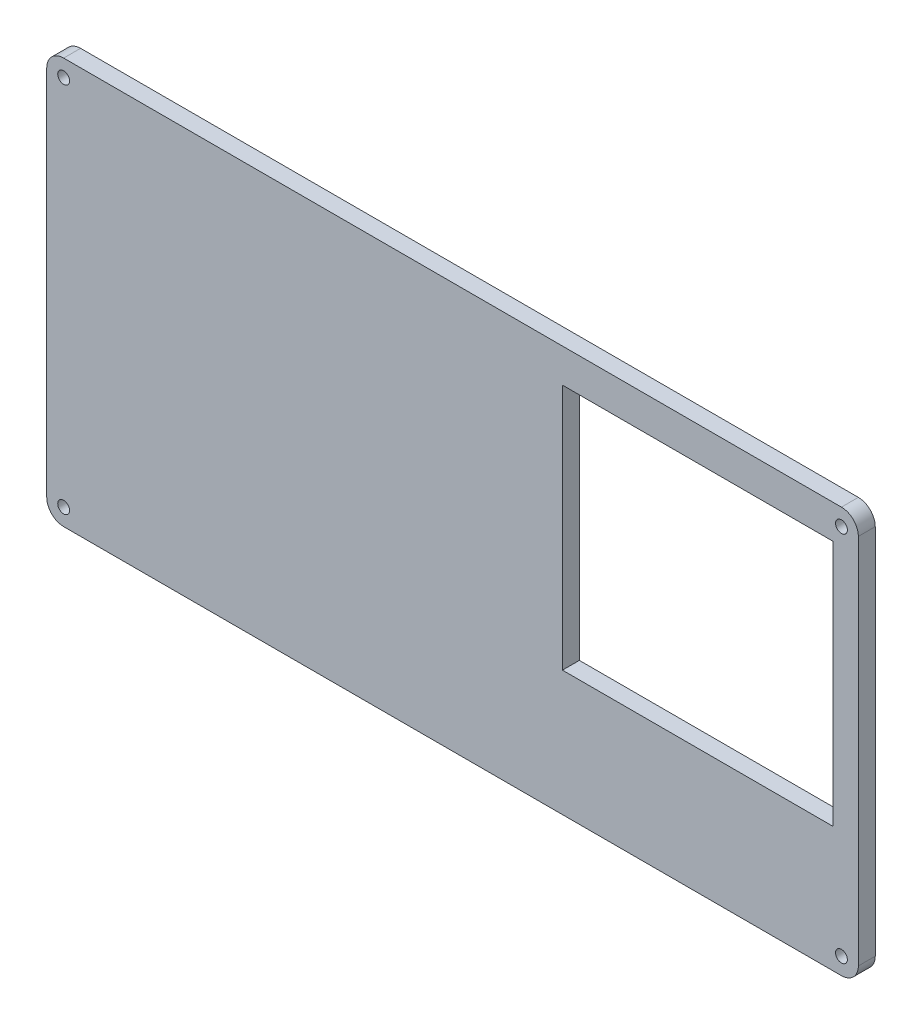
ISO-10303-21;
HEADER;
FILE_DESCRIPTION(('STEP AP214'),'2;1');
FILE_NAME('part.step','',(''),(''),'','','');
FILE_SCHEMA(('AUTOMOTIVE_DESIGN { 1 0 10303 214 1 1 1 1 }'));
ENDSEC;
DATA;
#1=APPLICATION_CONTEXT('core data for automotive mechanical design processes');
#2=APPLICATION_PROTOCOL_DEFINITION('international standard','automotive_design',2000,#1);
#3=PRODUCT_CONTEXT('',#1,'mechanical');
#4=PRODUCT('Part','Part','',(#3));
#5=PRODUCT_RELATED_PRODUCT_CATEGORY('part','',(#4));
#6=PRODUCT_DEFINITION_FORMATION('','',#4);
#7=PRODUCT_DEFINITION_CONTEXT('part definition',#1,'design');
#8=PRODUCT_DEFINITION('design','',#6,#7);
#9=PRODUCT_DEFINITION_SHAPE('','',#8);
#10=(LENGTH_UNIT() NAMED_UNIT(*) SI_UNIT(.MILLI.,.METRE.));
#11=(NAMED_UNIT(*) PLANE_ANGLE_UNIT() SI_UNIT($,.RADIAN.));
#12=(NAMED_UNIT(*) SI_UNIT($,.STERADIAN.) SOLID_ANGLE_UNIT());
#13=UNCERTAINTY_MEASURE_WITH_UNIT(LENGTH_MEASURE(1.E-05),#10,'distance_accuracy_value','');
#14=(GEOMETRIC_REPRESENTATION_CONTEXT(3) GLOBAL_UNCERTAINTY_ASSIGNED_CONTEXT((#13)) GLOBAL_UNIT_ASSIGNED_CONTEXT((#10,
#11,#12)) REPRESENTATION_CONTEXT('',''));
#15=CARTESIAN_POINT('',(0.,0.,0.));
#16=DIRECTION('',(0.,0.,1.));
#17=DIRECTION('',(1.,0.,0.));
#18=AXIS2_PLACEMENT_3D('',#15,#16,#17);
#19=CARTESIAN_POINT('',(-115.,54.9999999999999,5.));
#20=DIRECTION('',(0.,0.,-1.));
#21=DIRECTION('',(-1.,0.,0.));
#22=AXIS2_PLACEMENT_3D('',#19,#20,#21);
#23=CYLINDRICAL_SURFACE('',#22,4.99999999999996);
#24=CARTESIAN_POINT('',(-115.,54.9999999999999,0.));
#25=DIRECTION('',(0.,0.,1.));
#26=DIRECTION('',(1.,0.,0.));
#27=AXIS2_PLACEMENT_3D('',#24,#25,#26);
#28=CIRCLE('',#27,4.99999999999996);
#29=CARTESIAN_POINT('',(-115.,59.9999999999999,0.));
#30=VERTEX_POINT('',#29);
#31=CARTESIAN_POINT('',(-120.,55.,0.));
#32=VERTEX_POINT('',#31);
#33=EDGE_CURVE('E190',#30,#32,#28,.T.);
#34=ORIENTED_EDGE('',*,*,#33,.T.);
#35=DIRECTION('',(0.,0.,-1.));
#36=VECTOR('',#35,1.);
#37=CARTESIAN_POINT('',(-120.,55.,5.));
#38=LINE('',#37,#36);
#39=CARTESIAN_POINT('',(-120.,55.,5.));
#40=VERTEX_POINT('',#39);
#41=EDGE_CURVE('E11',#40,#32,#38,.T.);
#42=ORIENTED_EDGE('',*,*,#41,.F.);
#43=CARTESIAN_POINT('',(-115.,54.9999999999999,5.));
#44=DIRECTION('',(0.,0.,1.));
#45=DIRECTION('',(1.,0.,0.));
#46=AXIS2_PLACEMENT_3D('',#43,#44,#45);
#47=CIRCLE('',#46,4.99999999999996);
#48=CARTESIAN_POINT('',(-115.,59.9999999999999,5.));
#49=VERTEX_POINT('',#48);
#50=EDGE_CURVE('E189',#49,#40,#47,.T.);
#51=ORIENTED_EDGE('',*,*,#50,.F.);
#52=DIRECTION('',(0.,0.,-1.));
#53=VECTOR('',#52,1.);
#54=CARTESIAN_POINT('',(-115.,59.9999999999999,5.));
#55=LINE('',#54,#53);
#56=EDGE_CURVE('E208',#49,#30,#55,.T.);
#57=ORIENTED_EDGE('',*,*,#56,.T.);
#58=EDGE_LOOP('',(#34,#42,#51,#57));
#59=FACE_BOUND('',#58,.T.);
#60=ADVANCED_FACE('F41',(#59),#23,.T.);
#61=CARTESIAN_POINT('',(-120.,55.,5.));
#62=DIRECTION('',(1.,0.,0.));
#63=DIRECTION('',(0.,0.,-1.));
#64=AXIS2_PLACEMENT_3D('',#61,#62,#63);
#65=PLANE('',#64);
#66=DIRECTION('',(0.,-1.,0.));
#67=VECTOR('',#66,1.);
#68=CARTESIAN_POINT('',(-120.,55.,0.));
#69=LINE('',#68,#67);
#70=CARTESIAN_POINT('',(-120.,-55.,0.));
#71=VERTEX_POINT('',#70);
#72=EDGE_CURVE('E211',#32,#71,#69,.T.);
#73=ORIENTED_EDGE('',*,*,#72,.T.);
#74=DIRECTION('',(0.,0.,-1.));
#75=VECTOR('',#74,1.);
#76=CARTESIAN_POINT('',(-120.,-55.,5.));
#77=LINE('',#76,#75);
#78=CARTESIAN_POINT('',(-120.,-55.,5.));
#79=VERTEX_POINT('',#78);
#80=EDGE_CURVE('E48',#79,#71,#77,.T.);
#81=ORIENTED_EDGE('',*,*,#80,.F.);
#82=DIRECTION('',(0.,-1.,0.));
#83=VECTOR('',#82,1.);
#84=CARTESIAN_POINT('',(-120.,55.,5.));
#85=LINE('',#84,#83);
#86=EDGE_CURVE('E194',#40,#79,#85,.T.);
#87=ORIENTED_EDGE('',*,*,#86,.F.);
#88=ORIENTED_EDGE('',*,*,#41,.T.);
#89=EDGE_LOOP('',(#73,#81,#87,#88));
#90=FACE_BOUND('',#89,.T.);
#91=ADVANCED_FACE('F270',(#90),#65,.F.);
#92=CARTESIAN_POINT('',(-115.,-55.,5.));
#93=DIRECTION('',(0.,0.,-1.));
#94=DIRECTION('',(-1.,0.,0.));
#95=AXIS2_PLACEMENT_3D('',#92,#93,#94);
#96=CYLINDRICAL_SURFACE('',#95,4.99999999999995);
#97=CARTESIAN_POINT('',(-115.,-55.,0.));
#98=DIRECTION('',(0.,0.,1.));
#99=DIRECTION('',(1.,0.,0.));
#100=AXIS2_PLACEMENT_3D('',#97,#98,#99);
#101=CIRCLE('',#100,4.99999999999995);
#102=CARTESIAN_POINT('',(-115.,-59.9999999999999,0.));
#103=VERTEX_POINT('',#102);
#104=EDGE_CURVE('E213',#71,#103,#101,.T.);
#105=ORIENTED_EDGE('',*,*,#104,.T.);
#106=DIRECTION('',(0.,0.,-1.));
#107=VECTOR('',#106,1.);
#108=CARTESIAN_POINT('',(-115.,-59.9999999999999,5.));
#109=LINE('',#108,#107);
#110=CARTESIAN_POINT('',(-115.,-59.9999999999999,5.));
#111=VERTEX_POINT('',#110);
#112=EDGE_CURVE('E236',#111,#103,#109,.T.);
#113=ORIENTED_EDGE('',*,*,#112,.F.);
#114=CARTESIAN_POINT('',(-115.,-55.,5.));
#115=DIRECTION('',(0.,0.,1.));
#116=DIRECTION('',(1.,0.,0.));
#117=AXIS2_PLACEMENT_3D('',#114,#115,#116);
#118=CIRCLE('',#117,4.99999999999995);
#119=EDGE_CURVE('E198',#79,#111,#118,.T.);
#120=ORIENTED_EDGE('',*,*,#119,.F.);
#121=ORIENTED_EDGE('',*,*,#80,.T.);
#122=EDGE_LOOP('',(#105,#113,#120,#121));
#123=FACE_BOUND('',#122,.T.);
#124=ADVANCED_FACE('F244',(#123),#96,.T.);
#125=CARTESIAN_POINT('',(-115.,-59.9999999999999,5.));
#126=DIRECTION('',(0.,1.,0.));
#127=DIRECTION('',(-1.,0.,0.));
#128=AXIS2_PLACEMENT_3D('',#125,#126,#127);
#129=PLANE('',#128);
#130=DIRECTION('',(1.,0.,0.));
#131=VECTOR('',#130,1.);
#132=CARTESIAN_POINT('',(-115.,-59.9999999999999,0.));
#133=LINE('',#132,#131);
#134=CARTESIAN_POINT('',(115.,-59.9999999999999,0.));
#135=VERTEX_POINT('',#134);
#136=EDGE_CURVE('E214',#103,#135,#133,.T.);
#137=ORIENTED_EDGE('',*,*,#136,.T.);
#138=DIRECTION('',(0.,0.,-1.));
#139=VECTOR('',#138,1.);
#140=CARTESIAN_POINT('',(115.,-59.9999999999999,5.));
#141=LINE('',#140,#139);
#142=CARTESIAN_POINT('',(115.,-59.9999999999999,5.));
#143=VERTEX_POINT('',#142);
#144=EDGE_CURVE('E233',#143,#135,#141,.T.);
#145=ORIENTED_EDGE('',*,*,#144,.F.);
#146=DIRECTION('',(1.,0.,0.));
#147=VECTOR('',#146,1.);
#148=CARTESIAN_POINT('',(-115.,-59.9999999999999,5.));
#149=LINE('',#148,#147);
#150=EDGE_CURVE('E196',#111,#143,#149,.T.);
#151=ORIENTED_EDGE('',*,*,#150,.F.);
#152=ORIENTED_EDGE('',*,*,#112,.T.);
#153=EDGE_LOOP('',(#137,#145,#151,#152));
#154=FACE_BOUND('',#153,.T.);
#155=ADVANCED_FACE('F254',(#154),#129,.F.);
#156=CARTESIAN_POINT('',(115.,-55.,5.));
#157=DIRECTION('',(0.,0.,-1.));
#158=DIRECTION('',(-1.,0.,0.));
#159=AXIS2_PLACEMENT_3D('',#156,#157,#158);
#160=CYLINDRICAL_SURFACE('',#159,4.99999999999994);
#161=CARTESIAN_POINT('',(115.,-55.,0.));
#162=DIRECTION('',(0.,0.,1.));
#163=DIRECTION('',(-1.,0.,0.));
#164=AXIS2_PLACEMENT_3D('',#161,#162,#163);
#165=CIRCLE('',#164,4.99999999999994);
#166=CARTESIAN_POINT('',(120.,-54.9999999999999,0.));
#167=VERTEX_POINT('',#166);
#168=EDGE_CURVE('E220',#135,#167,#165,.T.);
#169=ORIENTED_EDGE('',*,*,#168,.T.);
#170=DIRECTION('',(0.,0.,-1.));
#171=VECTOR('',#170,1.);
#172=CARTESIAN_POINT('',(120.,-54.9999999999999,5.));
#173=LINE('',#172,#171);
#174=CARTESIAN_POINT('',(120.,-54.9999999999999,5.));
#175=VERTEX_POINT('',#174);
#176=EDGE_CURVE('E235',#175,#167,#173,.T.);
#177=ORIENTED_EDGE('',*,*,#176,.F.);
#178=CARTESIAN_POINT('',(115.,-55.,5.));
#179=DIRECTION('',(0.,0.,1.));
#180=DIRECTION('',(-1.,0.,0.));
#181=AXIS2_PLACEMENT_3D('',#178,#179,#180);
#182=CIRCLE('',#181,4.99999999999994);
#183=EDGE_CURVE('E199',#143,#175,#182,.T.);
#184=ORIENTED_EDGE('',*,*,#183,.F.);
#185=ORIENTED_EDGE('',*,*,#144,.T.);
#186=EDGE_LOOP('',(#169,#177,#184,#185));
#187=FACE_BOUND('',#186,.T.);
#188=ADVANCED_FACE('F259',(#187),#160,.T.);
#189=CARTESIAN_POINT('',(120.,55.,5.));
#190=DIRECTION('',(-1.,0.,0.));
#191=DIRECTION('',(0.,-1.,0.));
#192=AXIS2_PLACEMENT_3D('',#189,#190,#191);
#193=PLANE('',#192);
#194=DIRECTION('',(0.,1.,0.));
#195=VECTOR('',#194,1.);
#196=CARTESIAN_POINT('',(120.,55.,0.));
#197=LINE('',#196,#195);
#198=CARTESIAN_POINT('',(120.,55.,0.));
#199=VERTEX_POINT('',#198);
#200=EDGE_CURVE('E218',#167,#199,#197,.T.);
#201=ORIENTED_EDGE('',*,*,#200,.T.);
#202=DIRECTION('',(0.,0.,-1.));
#203=VECTOR('',#202,1.);
#204=CARTESIAN_POINT('',(120.,55.,5.));
#205=LINE('',#204,#203);
#206=CARTESIAN_POINT('',(120.,55.,5.));
#207=VERTEX_POINT('',#206);
#208=EDGE_CURVE('E228',#207,#199,#205,.T.);
#209=ORIENTED_EDGE('',*,*,#208,.F.);
#210=DIRECTION('',(0.,1.,0.));
#211=VECTOR('',#210,1.);
#212=CARTESIAN_POINT('',(120.,55.,5.));
#213=LINE('',#212,#211);
#214=EDGE_CURVE('E205',#175,#207,#213,.T.);
#215=ORIENTED_EDGE('',*,*,#214,.F.);
#216=ORIENTED_EDGE('',*,*,#176,.T.);
#217=EDGE_LOOP('',(#201,#209,#215,#216));
#218=FACE_BOUND('',#217,.T.);
#219=ADVANCED_FACE('F278',(#218),#193,.F.);
#220=CARTESIAN_POINT('',(115.,55.,5.));
#221=DIRECTION('',(0.,0.,-1.));
#222=DIRECTION('',(-1.,0.,0.));
#223=AXIS2_PLACEMENT_3D('',#220,#221,#222);
#224=CYLINDRICAL_SURFACE('',#223,4.99999999999996);
#225=CARTESIAN_POINT('',(115.,55.,0.));
#226=DIRECTION('',(0.,0.,1.));
#227=DIRECTION('',(-1.,0.,0.));
#228=AXIS2_PLACEMENT_3D('',#225,#226,#227);
#229=CIRCLE('',#228,4.99999999999996);
#230=CARTESIAN_POINT('',(115.,60.,0.));
#231=VERTEX_POINT('',#230);
#232=EDGE_CURVE('E222',#199,#231,#229,.T.);
#233=ORIENTED_EDGE('',*,*,#232,.T.);
#234=DIRECTION('',(0.,0.,-1.));
#235=VECTOR('',#234,1.);
#236=CARTESIAN_POINT('',(115.,60.,5.));
#237=LINE('',#236,#235);
#238=CARTESIAN_POINT('',(115.,60.,5.));
#239=VERTEX_POINT('',#238);
#240=EDGE_CURVE('E226',#239,#231,#237,.T.);
#241=ORIENTED_EDGE('',*,*,#240,.F.);
#242=CARTESIAN_POINT('',(115.,55.,5.));
#243=DIRECTION('',(0.,0.,1.));
#244=DIRECTION('',(-1.,0.,0.));
#245=AXIS2_PLACEMENT_3D('',#242,#243,#244);
#246=CIRCLE('',#245,4.99999999999996);
#247=EDGE_CURVE('E204',#207,#239,#246,.T.);
#248=ORIENTED_EDGE('',*,*,#247,.F.);
#249=ORIENTED_EDGE('',*,*,#208,.T.);
#250=EDGE_LOOP('',(#233,#241,#248,#249));
#251=FACE_BOUND('',#250,.T.);
#252=ADVANCED_FACE('F279',(#251),#224,.T.);
#253=CARTESIAN_POINT('',(-115.,59.9999999999999,5.));
#254=DIRECTION('',(0.,-1.,0.));
#255=DIRECTION('',(1.,0.,0.));
#256=AXIS2_PLACEMENT_3D('',#253,#254,#255);
#257=PLANE('',#256);
#258=DIRECTION('',(-1.,0.,0.));
#259=VECTOR('',#258,1.);
#260=CARTESIAN_POINT('',(-115.,59.9999999999999,0.));
#261=LINE('',#260,#259);
#262=EDGE_CURVE('E191',#231,#30,#261,.T.);
#263=ORIENTED_EDGE('',*,*,#262,.T.);
#264=ORIENTED_EDGE('',*,*,#56,.F.);
#265=DIRECTION('',(-1.,0.,0.));
#266=VECTOR('',#265,1.);
#267=CARTESIAN_POINT('',(-115.,59.9999999999999,5.));
#268=LINE('',#267,#266);
#269=EDGE_CURVE('E206',#239,#49,#268,.T.);
#270=ORIENTED_EDGE('',*,*,#269,.F.);
#271=ORIENTED_EDGE('',*,*,#240,.T.);
#272=EDGE_LOOP('',(#263,#264,#270,#271));
#273=FACE_BOUND('',#272,.T.);
#274=ADVANCED_FACE('F272',(#273),#257,.F.);
#275=CARTESIAN_POINT('',(-115.,54.9999999999999,5.));
#276=DIRECTION('',(0.,0.,1.));
#277=DIRECTION('',(1.,0.,0.));
#278=AXIS2_PLACEMENT_3D('',#275,#276,#277);
#279=PLANE('',#278);
#280=DIRECTION('',(0.,-1.,0.));
#281=VECTOR('',#280,1.);
#282=CARTESIAN_POINT('',(32.5,50.,5.));
#283=LINE('',#282,#281);
#284=CARTESIAN_POINT('',(32.5,50.,5.));
#285=VERTEX_POINT('',#284);
#286=CARTESIAN_POINT('',(32.5000000000001,-23.,5.));
#287=VERTEX_POINT('',#286);
#288=EDGE_CURVE('E54',#285,#287,#283,.T.);
#289=ORIENTED_EDGE('',*,*,#288,.F.);
#290=DIRECTION('',(-1.,0.,0.));
#291=VECTOR('',#290,1.);
#292=CARTESIAN_POINT('',(32.5,50.,5.));
#293=LINE('',#292,#291);
#294=CARTESIAN_POINT('',(112.5,50.,5.));
#295=VERTEX_POINT('',#294);
#296=EDGE_CURVE('E150',#295,#285,#293,.T.);
#297=ORIENTED_EDGE('',*,*,#296,.F.);
#298=DIRECTION('',(0.,1.,0.));
#299=VECTOR('',#298,1.);
#300=CARTESIAN_POINT('',(112.5,50.,5.));
#301=LINE('',#300,#299);
#302=CARTESIAN_POINT('',(112.5,-23.,5.));
#303=VERTEX_POINT('',#302);
#304=EDGE_CURVE('E147',#303,#295,#301,.T.);
#305=ORIENTED_EDGE('',*,*,#304,.F.);
#306=DIRECTION('',(1.,0.,0.));
#307=VECTOR('',#306,1.);
#308=CARTESIAN_POINT('',(32.5,-23.,5.));
#309=LINE('',#308,#307);
#310=EDGE_CURVE('E156',#287,#303,#309,.T.);
#311=ORIENTED_EDGE('',*,*,#310,.F.);
#312=EDGE_LOOP('',(#289,#297,#305,#311));
#313=FACE_BOUND('',#312,.T.);
#314=CARTESIAN_POINT('',(-115.,-54.9999999999999,5.));
#315=DIRECTION('',(0.,0.,1.));
#316=DIRECTION('',(-1.,0.,0.));
#317=AXIS2_PLACEMENT_3D('',#314,#315,#316);
#318=CIRCLE('',#317,1.75);
#319=CARTESIAN_POINT('',(-116.75,-54.9999999999999,5.));
#320=VERTEX_POINT('',#319);
#321=EDGE_CURVE('E176',#320,#320,#318,.T.);
#322=ORIENTED_EDGE('',*,*,#321,.F.);
#323=EDGE_LOOP('',(#322));
#324=FACE_BOUND('',#323,.T.);
#325=CARTESIAN_POINT('',(115.,-55.,5.));
#326=DIRECTION('',(0.,0.,1.));
#327=DIRECTION('',(1.,0.,0.));
#328=AXIS2_PLACEMENT_3D('',#325,#326,#327);
#329=CIRCLE('',#328,1.75);
#330=CARTESIAN_POINT('',(116.75,-55.,5.));
#331=VERTEX_POINT('',#330);
#332=EDGE_CURVE('E172',#331,#331,#329,.T.);
#333=ORIENTED_EDGE('',*,*,#332,.F.);
#334=EDGE_LOOP('',(#333));
#335=FACE_BOUND('',#334,.T.);
#336=CARTESIAN_POINT('',(115.,55.,5.));
#337=DIRECTION('',(0.,0.,1.));
#338=DIRECTION('',(-1.,0.,0.));
#339=AXIS2_PLACEMENT_3D('',#336,#337,#338);
#340=CIRCLE('',#339,1.75);
#341=CARTESIAN_POINT('',(113.25,55.,5.));
#342=VERTEX_POINT('',#341);
#343=EDGE_CURVE('E167',#342,#342,#340,.T.);
#344=ORIENTED_EDGE('',*,*,#343,.F.);
#345=EDGE_LOOP('',(#344));
#346=FACE_BOUND('',#345,.T.);
#347=CARTESIAN_POINT('',(-115.,54.9999999999999,5.));
#348=DIRECTION('',(0.,0.,1.));
#349=DIRECTION('',(1.,0.,0.));
#350=AXIS2_PLACEMENT_3D('',#347,#348,#349);
#351=CIRCLE('',#350,1.75);
#352=CARTESIAN_POINT('',(-113.25,54.9999999999999,5.));
#353=VERTEX_POINT('',#352);
#354=EDGE_CURVE('E166',#353,#353,#351,.T.);
#355=ORIENTED_EDGE('',*,*,#354,.F.);
#356=EDGE_LOOP('',(#355));
#357=FACE_BOUND('',#356,.T.);
#358=ORIENTED_EDGE('',*,*,#50,.T.);
#359=ORIENTED_EDGE('',*,*,#86,.T.);
#360=ORIENTED_EDGE('',*,*,#119,.T.);
#361=ORIENTED_EDGE('',*,*,#150,.T.);
#362=ORIENTED_EDGE('',*,*,#183,.T.);
#363=ORIENTED_EDGE('',*,*,#214,.T.);
#364=ORIENTED_EDGE('',*,*,#247,.T.);
#365=ORIENTED_EDGE('',*,*,#269,.T.);
#366=EDGE_LOOP('',(#358,#359,#360,#361,#362,#363,#364,#365));
#367=FACE_BOUND('',#366,.T.);
#368=ADVANCED_FACE('F263',(#313,#324,#335,#346,#357,#367),#279,.T.);
#369=CARTESIAN_POINT('',(-115.,54.9999999999999,0.));
#370=DIRECTION('',(0.,0.,1.));
#371=DIRECTION('',(1.,0.,0.));
#372=AXIS2_PLACEMENT_3D('',#369,#370,#371);
#373=PLANE('',#372);
#374=DIRECTION('',(-1.,0.,0.));
#375=VECTOR('',#374,1.);
#376=CARTESIAN_POINT('',(32.5,50.,0.));
#377=LINE('',#376,#375);
#378=CARTESIAN_POINT('',(112.5,50.,0.));
#379=VERTEX_POINT('',#378);
#380=CARTESIAN_POINT('',(32.5,50.,0.));
#381=VERTEX_POINT('',#380);
#382=EDGE_CURVE('E140',#379,#381,#377,.T.);
#383=ORIENTED_EDGE('',*,*,#382,.T.);
#384=DIRECTION('',(0.,-1.,0.));
#385=VECTOR('',#384,1.);
#386=CARTESIAN_POINT('',(32.5,50.,0.));
#387=LINE('',#386,#385);
#388=CARTESIAN_POINT('',(32.5,-23.,0.));
#389=VERTEX_POINT('',#388);
#390=EDGE_CURVE('E131',#381,#389,#387,.T.);
#391=ORIENTED_EDGE('',*,*,#390,.T.);
#392=DIRECTION('',(1.,0.,0.));
#393=VECTOR('',#392,1.);
#394=CARTESIAN_POINT('',(32.5,-23.,0.));
#395=LINE('',#394,#393);
#396=CARTESIAN_POINT('',(112.5,-23.,0.));
#397=VERTEX_POINT('',#396);
#398=EDGE_CURVE('E138',#389,#397,#395,.T.);
#399=ORIENTED_EDGE('',*,*,#398,.T.);
#400=DIRECTION('',(0.,1.,0.));
#401=VECTOR('',#400,1.);
#402=CARTESIAN_POINT('',(112.5,50.,0.));
#403=LINE('',#402,#401);
#404=EDGE_CURVE('E62',#397,#379,#403,.T.);
#405=ORIENTED_EDGE('',*,*,#404,.T.);
#406=EDGE_LOOP('',(#383,#391,#399,#405));
#407=FACE_BOUND('',#406,.T.);
#408=CARTESIAN_POINT('',(-115.,-54.9999999999999,0.));
#409=DIRECTION('',(0.,0.,1.));
#410=DIRECTION('',(-1.,0.,0.));
#411=AXIS2_PLACEMENT_3D('',#408,#409,#410);
#412=CIRCLE('',#411,1.75);
#413=CARTESIAN_POINT('',(-116.75,-54.9999999999999,0.));
#414=VERTEX_POINT('',#413);
#415=EDGE_CURVE('E165',#414,#414,#412,.T.);
#416=ORIENTED_EDGE('',*,*,#415,.T.);
#417=EDGE_LOOP('',(#416));
#418=FACE_BOUND('',#417,.T.);
#419=CARTESIAN_POINT('',(115.,-55.,0.));
#420=DIRECTION('',(0.,0.,1.));
#421=DIRECTION('',(1.,0.,0.));
#422=AXIS2_PLACEMENT_3D('',#419,#420,#421);
#423=CIRCLE('',#422,1.75);
#424=CARTESIAN_POINT('',(116.75,-55.,0.));
#425=VERTEX_POINT('',#424);
#426=EDGE_CURVE('E177',#425,#425,#423,.T.);
#427=ORIENTED_EDGE('',*,*,#426,.T.);
#428=EDGE_LOOP('',(#427));
#429=FACE_BOUND('',#428,.T.);
#430=CARTESIAN_POINT('',(115.,55.,0.));
#431=DIRECTION('',(0.,0.,1.));
#432=DIRECTION('',(-1.,0.,0.));
#433=AXIS2_PLACEMENT_3D('',#430,#431,#432);
#434=CIRCLE('',#433,1.75);
#435=CARTESIAN_POINT('',(113.25,55.,0.));
#436=VERTEX_POINT('',#435);
#437=EDGE_CURVE('E168',#436,#436,#434,.T.);
#438=ORIENTED_EDGE('',*,*,#437,.T.);
#439=EDGE_LOOP('',(#438));
#440=FACE_BOUND('',#439,.T.);
#441=CARTESIAN_POINT('',(-115.,54.9999999999999,0.));
#442=DIRECTION('',(0.,0.,1.));
#443=DIRECTION('',(1.,0.,0.));
#444=AXIS2_PLACEMENT_3D('',#441,#442,#443);
#445=CIRCLE('',#444,1.75);
#446=CARTESIAN_POINT('',(-113.25,54.9999999999999,0.));
#447=VERTEX_POINT('',#446);
#448=EDGE_CURVE('E184',#447,#447,#445,.T.);
#449=ORIENTED_EDGE('',*,*,#448,.T.);
#450=EDGE_LOOP('',(#449));
#451=FACE_BOUND('',#450,.T.);
#452=ORIENTED_EDGE('',*,*,#33,.F.);
#453=ORIENTED_EDGE('',*,*,#262,.F.);
#454=ORIENTED_EDGE('',*,*,#232,.F.);
#455=ORIENTED_EDGE('',*,*,#200,.F.);
#456=ORIENTED_EDGE('',*,*,#168,.F.);
#457=ORIENTED_EDGE('',*,*,#136,.F.);
#458=ORIENTED_EDGE('',*,*,#104,.F.);
#459=ORIENTED_EDGE('',*,*,#72,.F.);
#460=EDGE_LOOP('',(#452,#453,#454,#455,#456,#457,#458,#459));
#461=FACE_BOUND('',#460,.T.);
#462=ADVANCED_FACE('F145',(#407,#418,#429,#440,#451,#461),#373,.F.);
#463=CARTESIAN_POINT('',(-115.,54.9999999999999,0.));
#464=DIRECTION('',(0.,0.,1.));
#465=DIRECTION('',(1.,0.,0.));
#466=AXIS2_PLACEMENT_3D('',#463,#464,#465);
#467=CYLINDRICAL_SURFACE('',#466,1.75);
#468=ORIENTED_EDGE('',*,*,#448,.F.);
#469=EDGE_LOOP('',(#468));
#470=FACE_BOUND('',#469,.T.);
#471=ORIENTED_EDGE('',*,*,#354,.T.);
#472=EDGE_LOOP('',(#471));
#473=FACE_BOUND('',#472,.T.);
#474=ADVANCED_FACE('F350',(#470,#473),#467,.F.);
#475=CARTESIAN_POINT('',(115.,55.,0.));
#476=DIRECTION('',(0.,0.,1.));
#477=DIRECTION('',(1.,0.,0.));
#478=AXIS2_PLACEMENT_3D('',#475,#476,#477);
#479=CYLINDRICAL_SURFACE('',#478,1.75);
#480=ORIENTED_EDGE('',*,*,#437,.F.);
#481=EDGE_LOOP('',(#480));
#482=FACE_BOUND('',#481,.T.);
#483=ORIENTED_EDGE('',*,*,#343,.T.);
#484=EDGE_LOOP('',(#483));
#485=FACE_BOUND('',#484,.T.);
#486=ADVANCED_FACE('F357',(#482,#485),#479,.F.);
#487=CARTESIAN_POINT('',(115.,-55.,0.));
#488=DIRECTION('',(0.,0.,1.));
#489=DIRECTION('',(1.,0.,0.));
#490=AXIS2_PLACEMENT_3D('',#487,#488,#489);
#491=CYLINDRICAL_SURFACE('',#490,1.75);
#492=ORIENTED_EDGE('',*,*,#426,.F.);
#493=EDGE_LOOP('',(#492));
#494=FACE_BOUND('',#493,.T.);
#495=ORIENTED_EDGE('',*,*,#332,.T.);
#496=EDGE_LOOP('',(#495));
#497=FACE_BOUND('',#496,.T.);
#498=ADVANCED_FACE('F368',(#494,#497),#491,.F.);
#499=CARTESIAN_POINT('',(-115.,-54.9999999999999,0.));
#500=DIRECTION('',(0.,0.,1.));
#501=DIRECTION('',(1.,0.,0.));
#502=AXIS2_PLACEMENT_3D('',#499,#500,#501);
#503=CYLINDRICAL_SURFACE('',#502,1.75);
#504=ORIENTED_EDGE('',*,*,#415,.F.);
#505=EDGE_LOOP('',(#504));
#506=FACE_BOUND('',#505,.T.);
#507=ORIENTED_EDGE('',*,*,#321,.T.);
#508=EDGE_LOOP('',(#507));
#509=FACE_BOUND('',#508,.T.);
#510=ADVANCED_FACE('F376',(#506,#509),#503,.F.);
#511=CARTESIAN_POINT('',(32.5,50.,0.));
#512=DIRECTION('',(-1.,0.,0.));
#513=DIRECTION('',(0.,-1.,0.));
#514=AXIS2_PLACEMENT_3D('',#511,#512,#513);
#515=PLANE('',#514);
#516=ORIENTED_EDGE('',*,*,#288,.T.);
#517=DIRECTION('',(0.,0.,1.));
#518=VECTOR('',#517,1.);
#519=CARTESIAN_POINT('',(32.5,-23.,0.));
#520=LINE('',#519,#518);
#521=EDGE_CURVE('E130',#389,#287,#520,.T.);
#522=ORIENTED_EDGE('',*,*,#521,.F.);
#523=ORIENTED_EDGE('',*,*,#390,.F.);
#524=DIRECTION('',(0.,0.,1.));
#525=VECTOR('',#524,1.);
#526=CARTESIAN_POINT('',(32.5,50.,0.));
#527=LINE('',#526,#525);
#528=EDGE_CURVE('E159',#381,#285,#527,.T.);
#529=ORIENTED_EDGE('',*,*,#528,.T.);
#530=EDGE_LOOP('',(#516,#522,#523,#529));
#531=FACE_BOUND('',#530,.T.);
#532=ADVANCED_FACE('F129',(#531),#515,.F.);
#533=CARTESIAN_POINT('',(32.5,50.,0.));
#534=DIRECTION('',(0.,1.,0.));
#535=DIRECTION('',(-1.,0.,0.));
#536=AXIS2_PLACEMENT_3D('',#533,#534,#535);
#537=PLANE('',#536);
#538=ORIENTED_EDGE('',*,*,#296,.T.);
#539=ORIENTED_EDGE('',*,*,#528,.F.);
#540=ORIENTED_EDGE('',*,*,#382,.F.);
#541=DIRECTION('',(0.,0.,1.));
#542=VECTOR('',#541,1.);
#543=CARTESIAN_POINT('',(112.5,50.,0.));
#544=LINE('',#543,#542);
#545=EDGE_CURVE('E162',#379,#295,#544,.T.);
#546=ORIENTED_EDGE('',*,*,#545,.T.);
#547=EDGE_LOOP('',(#538,#539,#540,#546));
#548=FACE_BOUND('',#547,.T.);
#549=ADVANCED_FACE('F392',(#548),#537,.F.);
#550=CARTESIAN_POINT('',(112.5,50.,0.));
#551=DIRECTION('',(1.,0.,0.));
#552=DIRECTION('',(0.,1.,0.));
#553=AXIS2_PLACEMENT_3D('',#550,#551,#552);
#554=PLANE('',#553);
#555=ORIENTED_EDGE('',*,*,#304,.T.);
#556=ORIENTED_EDGE('',*,*,#545,.F.);
#557=ORIENTED_EDGE('',*,*,#404,.F.);
#558=DIRECTION('',(0.,0.,1.));
#559=VECTOR('',#558,1.);
#560=CARTESIAN_POINT('',(112.5,-23.,0.));
#561=LINE('',#560,#559);
#562=EDGE_CURVE('E137',#397,#303,#561,.T.);
#563=ORIENTED_EDGE('',*,*,#562,.T.);
#564=EDGE_LOOP('',(#555,#556,#557,#563));
#565=FACE_BOUND('',#564,.T.);
#566=ADVANCED_FACE('F405',(#565),#554,.F.);
#567=CARTESIAN_POINT('',(32.5,-23.,0.));
#568=DIRECTION('',(0.,-1.,0.));
#569=DIRECTION('',(1.,0.,0.));
#570=AXIS2_PLACEMENT_3D('',#567,#568,#569);
#571=PLANE('',#570);
#572=ORIENTED_EDGE('',*,*,#310,.T.);
#573=ORIENTED_EDGE('',*,*,#562,.F.);
#574=ORIENTED_EDGE('',*,*,#398,.F.);
#575=ORIENTED_EDGE('',*,*,#521,.T.);
#576=EDGE_LOOP('',(#572,#573,#574,#575));
#577=FACE_BOUND('',#576,.T.);
#578=ADVANCED_FACE('F143',(#577),#571,.F.);
#579=CLOSED_SHELL('',(#60,#91,#124,#155,#188,#219,#252,#274,#368,#462,#474,#486,#498,#510,#532,
#549,#566,#578));
#580=MANIFOLD_SOLID_BREP('B2',#579);
#581=ADVANCED_BREP_SHAPE_REPRESENTATION('',(#18,#580),#14);
#582=SHAPE_DEFINITION_REPRESENTATION(#9,#581);
ENDSEC;
END-ISO-10303-21;
